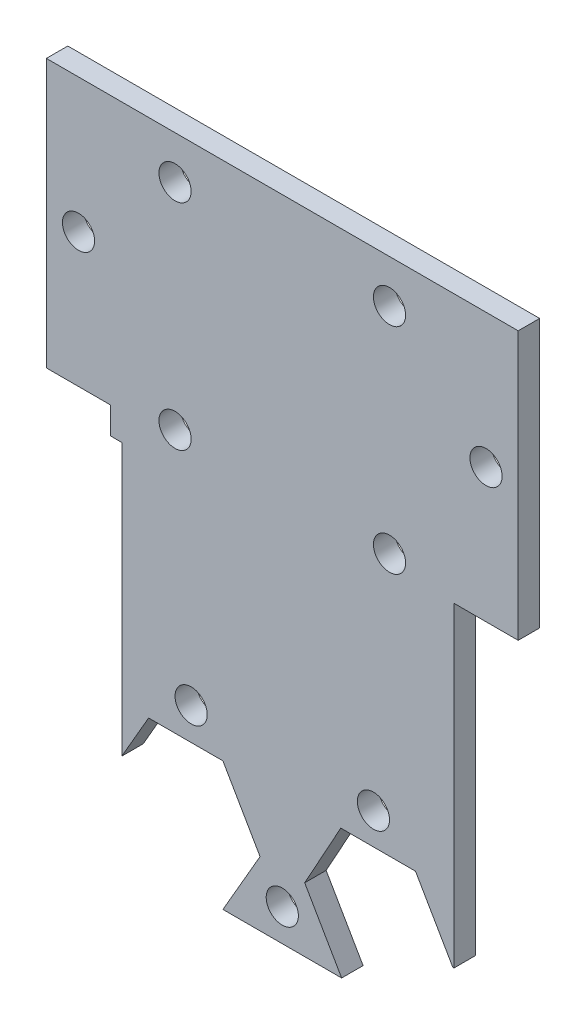
ISO-10303-21;
HEADER;
FILE_DESCRIPTION(('STEP AP214'),'2;1');
FILE_NAME('part.step','',(''),(''),'','','');
FILE_SCHEMA(('AUTOMOTIVE_DESIGN { 1 0 10303 214 1 1 1 1 }'));
ENDSEC;
DATA;
#1=APPLICATION_CONTEXT('core data for automotive mechanical design processes');
#2=APPLICATION_PROTOCOL_DEFINITION('international standard','automotive_design',2000,#1);
#3=PRODUCT_CONTEXT('',#1,'mechanical');
#4=PRODUCT('Part','Part','',(#3));
#5=PRODUCT_RELATED_PRODUCT_CATEGORY('part','',(#4));
#6=PRODUCT_DEFINITION_FORMATION('','',#4);
#7=PRODUCT_DEFINITION_CONTEXT('part definition',#1,'design');
#8=PRODUCT_DEFINITION('design','',#6,#7);
#9=PRODUCT_DEFINITION_SHAPE('','',#8);
#10=(LENGTH_UNIT() NAMED_UNIT(*) SI_UNIT(.MILLI.,.METRE.));
#11=(NAMED_UNIT(*) PLANE_ANGLE_UNIT() SI_UNIT($,.RADIAN.));
#12=(NAMED_UNIT(*) SI_UNIT($,.STERADIAN.) SOLID_ANGLE_UNIT());
#13=UNCERTAINTY_MEASURE_WITH_UNIT(LENGTH_MEASURE(1.E-05),#10,'distance_accuracy_value','');
#14=(GEOMETRIC_REPRESENTATION_CONTEXT(3) GLOBAL_UNCERTAINTY_ASSIGNED_CONTEXT((#13)) GLOBAL_UNIT_ASSIGNED_CONTEXT((#10,
#11,#12)) REPRESENTATION_CONTEXT('',''));
#15=CARTESIAN_POINT('',(0.,0.,0.));
#16=DIRECTION('',(0.,0.,1.));
#17=DIRECTION('',(1.,0.,0.));
#18=AXIS2_PLACEMENT_3D('',#15,#16,#17);
#19=CARTESIAN_POINT('',(16.0000000000013,0.,2.));
#20=DIRECTION('',(1.,0.,0.));
#21=DIRECTION('',(0.,1.,0.));
#22=AXIS2_PLACEMENT_3D('',#19,#20,#21);
#23=PLANE('',#22);
#24=DIRECTION('',(0.,0.,1.));
#25=VECTOR('',#24,1.);
#26=CARTESIAN_POINT('',(16.0000000000013,-40.4668979539107,2.));
#27=LINE('',#26,#25);
#28=CARTESIAN_POINT('',(16.0000000000013,-40.4668979539107,0.));
#29=VERTEX_POINT('',#28);
#30=CARTESIAN_POINT('',(16.0000000000013,-40.4668979539107,2.));
#31=VERTEX_POINT('',#30);
#32=EDGE_CURVE('E173',#29,#31,#27,.T.);
#33=ORIENTED_EDGE('',*,*,#32,.F.);
#34=DIRECTION('',(0.,-1.,0.));
#35=VECTOR('',#34,1.);
#36=CARTESIAN_POINT('',(16.0000000000013,0.,0.));
#37=LINE('',#36,#35);
#38=CARTESIAN_POINT('',(15.9999999999987,-10.9999999999692,0.));
#39=VERTEX_POINT('',#38);
#40=EDGE_CURVE('E271',#39,#29,#37,.T.);
#41=ORIENTED_EDGE('',*,*,#40,.F.);
#42=DIRECTION('',(0.,0.,-1.));
#43=VECTOR('',#42,1.);
#44=CARTESIAN_POINT('',(15.9999999999987,-10.9999999999692,27.7099202643649));
#45=LINE('',#44,#43);
#46=CARTESIAN_POINT('',(16.0000000000013,-10.9999999999692,2.));
#47=VERTEX_POINT('',#46);
#48=EDGE_CURVE('E56',#47,#39,#45,.T.);
#49=ORIENTED_EDGE('',*,*,#48,.F.);
#50=DIRECTION('',(0.,-1.,0.));
#51=VECTOR('',#50,1.);
#52=CARTESIAN_POINT('',(16.0000000000013,0.,2.));
#53=LINE('',#52,#51);
#54=EDGE_CURVE('E185',#47,#31,#53,.T.);
#55=ORIENTED_EDGE('',*,*,#54,.T.);
#56=EDGE_LOOP('',(#33,#41,#49,#55));
#57=FACE_BOUND('',#56,.T.);
#58=ADVANCED_FACE('F41',(#57),#23,.T.);
#59=CARTESIAN_POINT('',(0.,14.0000000000308,2.));
#60=DIRECTION('',(0.,1.,0.));
#61=DIRECTION('',(0.,0.,1.));
#62=AXIS2_PLACEMENT_3D('',#59,#60,#61);
#63=PLANE('',#62);
#64=DIRECTION('',(1.,0.,0.));
#65=VECTOR('',#64,1.);
#66=CARTESIAN_POINT('',(0.,14.0000000000308,0.));
#67=LINE('',#66,#65);
#68=CARTESIAN_POINT('',(-21.9999999999987,14.0000000000308,0.));
#69=VERTEX_POINT('',#68);
#70=CARTESIAN_POINT('',(21.9999999999987,14.0000000000308,0.));
#71=VERTEX_POINT('',#70);
#72=EDGE_CURVE('E274',#69,#71,#67,.T.);
#73=ORIENTED_EDGE('',*,*,#72,.F.);
#74=DIRECTION('',(0.,0.,-1.));
#75=VECTOR('',#74,1.);
#76=CARTESIAN_POINT('',(-21.9999999999987,14.0000000000308,27.7099202643649));
#77=LINE('',#76,#75);
#78=CARTESIAN_POINT('',(-21.9999999999987,14.0000000000308,2.));
#79=VERTEX_POINT('',#78);
#80=EDGE_CURVE('E410',#79,#69,#77,.T.);
#81=ORIENTED_EDGE('',*,*,#80,.F.);
#82=DIRECTION('',(1.,0.,0.));
#83=VECTOR('',#82,1.);
#84=CARTESIAN_POINT('',(0.,14.0000000000308,2.));
#85=LINE('',#84,#83);
#86=CARTESIAN_POINT('',(21.9999999999987,14.0000000000308,2.00000000000001));
#87=VERTEX_POINT('',#86);
#88=EDGE_CURVE('E193',#79,#87,#85,.T.);
#89=ORIENTED_EDGE('',*,*,#88,.T.);
#90=DIRECTION('',(0.,0.,-1.));
#91=VECTOR('',#90,1.);
#92=CARTESIAN_POINT('',(21.9999999999987,14.0000000000308,27.7099202643649));
#93=LINE('',#92,#91);
#94=EDGE_CURVE('E436',#87,#71,#93,.T.);
#95=ORIENTED_EDGE('',*,*,#94,.T.);
#96=EDGE_LOOP('',(#73,#81,#89,#95));
#97=FACE_BOUND('',#96,.T.);
#98=ADVANCED_FACE('F470',(#97),#63,.T.);
#99=CARTESIAN_POINT('',(-15.9999999999987,0.,2.));
#100=DIRECTION('',(1.,0.,0.));
#101=DIRECTION('',(0.,1.,0.));
#102=AXIS2_PLACEMENT_3D('',#99,#100,#101);
#103=PLANE('',#102);
#104=DIRECTION('',(0.,-1.,0.));
#105=VECTOR('',#104,1.);
#106=CARTESIAN_POINT('',(-15.9999999999987,0.,2.));
#107=LINE('',#106,#105);
#108=CARTESIAN_POINT('',(-15.9999999999987,-10.9999999999692,2.));
#109=VERTEX_POINT('',#108);
#110=CARTESIAN_POINT('',(-15.9999999999987,-13.4999999999692,2.));
#111=VERTEX_POINT('',#110);
#112=EDGE_CURVE('E198',#109,#111,#107,.T.);
#113=ORIENTED_EDGE('',*,*,#112,.F.);
#114=DIRECTION('',(0.,0.,-1.));
#115=VECTOR('',#114,1.);
#116=CARTESIAN_POINT('',(-15.9999999999987,-10.9999999999692,27.7099202643649));
#117=LINE('',#116,#115);
#118=CARTESIAN_POINT('',(-15.9999999999987,-10.9999999999692,0.));
#119=VERTEX_POINT('',#118);
#120=EDGE_CURVE('E204',#109,#119,#117,.T.);
#121=ORIENTED_EDGE('',*,*,#120,.T.);
#122=DIRECTION('',(0.,-1.,0.));
#123=VECTOR('',#122,1.);
#124=CARTESIAN_POINT('',(-15.9999999999987,0.,0.));
#125=LINE('',#124,#123);
#126=CARTESIAN_POINT('',(-15.9999999999987,-13.4999999999692,0.));
#127=VERTEX_POINT('',#126);
#128=EDGE_CURVE('E278',#119,#127,#125,.T.);
#129=ORIENTED_EDGE('',*,*,#128,.T.);
#130=DIRECTION('',(0.,0.,-1.));
#131=VECTOR('',#130,1.);
#132=CARTESIAN_POINT('',(-15.9999999999987,-13.4999999999692,2.));
#133=LINE('',#132,#131);
#134=EDGE_CURVE('E49',#111,#127,#133,.T.);
#135=ORIENTED_EDGE('',*,*,#134,.F.);
#136=EDGE_LOOP('',(#113,#121,#129,#135));
#137=FACE_BOUND('',#136,.T.);
#138=ADVANCED_FACE('F403',(#137),#103,.F.);
#139=CARTESIAN_POINT('',(0.,-13.4999999999692,2.));
#140=DIRECTION('',(0.,1.,0.));
#141=DIRECTION('',(-1.,0.,0.));
#142=AXIS2_PLACEMENT_3D('',#139,#140,#141);
#143=PLANE('',#142);
#144=DIRECTION('',(1.,0.,0.));
#145=VECTOR('',#144,1.);
#146=CARTESIAN_POINT('',(0.,-13.4999999999692,0.));
#147=LINE('',#146,#145);
#148=CARTESIAN_POINT('',(-14.9692936452084,-13.4999999999692,0.));
#149=VERTEX_POINT('',#148);
#150=EDGE_CURVE('E281',#127,#149,#147,.T.);
#151=ORIENTED_EDGE('',*,*,#150,.T.);
#152=DIRECTION('',(0.,0.,-1.));
#153=VECTOR('',#152,1.);
#154=CARTESIAN_POINT('',(-14.9692936452084,-13.4999999999692,2.));
#155=LINE('',#154,#153);
#156=CARTESIAN_POINT('',(-14.9692936452084,-13.4999999999692,2.));
#157=VERTEX_POINT('',#156);
#158=EDGE_CURVE('E377',#157,#149,#155,.T.);
#159=ORIENTED_EDGE('',*,*,#158,.F.);
#160=DIRECTION('',(1.,0.,0.));
#161=VECTOR('',#160,1.);
#162=CARTESIAN_POINT('',(0.,-13.4999999999692,2.));
#163=LINE('',#162,#161);
#164=EDGE_CURVE('E209',#111,#157,#163,.T.);
#165=ORIENTED_EDGE('',*,*,#164,.F.);
#166=ORIENTED_EDGE('',*,*,#134,.T.);
#167=EDGE_LOOP('',(#151,#159,#165,#166));
#168=FACE_BOUND('',#167,.T.);
#169=ADVANCED_FACE('F385',(#168),#143,.F.);
#170=CARTESIAN_POINT('',(-14.9692936452084,0.,2.));
#171=DIRECTION('',(-1.,0.,0.));
#172=DIRECTION('',(0.,0.,1.));
#173=AXIS2_PLACEMENT_3D('',#170,#171,#172);
#174=PLANE('',#173);
#175=DIRECTION('',(0.,1.,0.));
#176=VECTOR('',#175,1.);
#177=CARTESIAN_POINT('',(-14.9692936452084,0.,0.));
#178=LINE('',#177,#176);
#179=CARTESIAN_POINT('',(-14.9692936452084,-38.8391198787935,0.));
#180=VERTEX_POINT('',#179);
#181=EDGE_CURVE('E285',#180,#149,#178,.T.);
#182=ORIENTED_EDGE('',*,*,#181,.F.);
#183=DIRECTION('',(0.,0.,-1.));
#184=VECTOR('',#183,1.);
#185=CARTESIAN_POINT('',(-14.9692936452084,-38.8391198787935,2.));
#186=LINE('',#185,#184);
#187=CARTESIAN_POINT('',(-14.9692936452084,-38.8391198787935,2.));
#188=VERTEX_POINT('',#187);
#189=EDGE_CURVE('E374',#188,#180,#186,.T.);
#190=ORIENTED_EDGE('',*,*,#189,.F.);
#191=DIRECTION('',(0.,1.,0.));
#192=VECTOR('',#191,1.);
#193=CARTESIAN_POINT('',(-14.9692936452084,0.,2.));
#194=LINE('',#193,#192);
#195=EDGE_CURVE('E212',#188,#157,#194,.T.);
#196=ORIENTED_EDGE('',*,*,#195,.T.);
#197=ORIENTED_EDGE('',*,*,#158,.T.);
#198=EDGE_LOOP('',(#182,#190,#196,#197));
#199=FACE_BOUND('',#198,.T.);
#200=ADVANCED_FACE('F397',(#199),#174,.T.);
#201=CARTESIAN_POINT('',(5.59086200393073,-3.22788568297257,2.));
#202=DIRECTION('',(-0.866025403784364,0.500000000000129,0.));
#203=DIRECTION('',(-0.500000000000129,-0.866025403784364,0.));
#204=AXIS2_PLACEMENT_3D('',#201,#202,#203);
#205=PLANE('',#204);
#206=DIRECTION('',(0.500000000000129,0.866025403784364,0.));
#207=VECTOR('',#206,1.);
#208=CARTESIAN_POINT('',(5.59086200393073,-3.22788568297257,0.));
#209=LINE('',#208,#207);
#210=CARTESIAN_POINT('',(-12.4641016151356,-34.4999999999924,0.));
#211=VERTEX_POINT('',#210);
#212=EDGE_CURVE('E289',#180,#211,#209,.T.);
#213=ORIENTED_EDGE('',*,*,#212,.T.);
#214=DIRECTION('',(0.,0.,-1.));
#215=VECTOR('',#214,1.);
#216=CARTESIAN_POINT('',(-12.4641016151356,-34.4999999999924,2.));
#217=LINE('',#216,#215);
#218=CARTESIAN_POINT('',(-12.4641016151356,-34.4999999999924,2.));
#219=VERTEX_POINT('',#218);
#220=EDGE_CURVE('E370',#219,#211,#217,.T.);
#221=ORIENTED_EDGE('',*,*,#220,.F.);
#222=DIRECTION('',(0.500000000000129,0.866025403784364,0.));
#223=VECTOR('',#222,1.);
#224=CARTESIAN_POINT('',(5.59086200393073,-3.22788568297257,2.));
#225=LINE('',#224,#223);
#226=EDGE_CURVE('E216',#188,#219,#225,.T.);
#227=ORIENTED_EDGE('',*,*,#226,.F.);
#228=ORIENTED_EDGE('',*,*,#189,.T.);
#229=EDGE_LOOP('',(#213,#221,#227,#228));
#230=FACE_BOUND('',#229,.T.);
#231=ADVANCED_FACE('F506',(#230),#205,.F.);
#232=CARTESIAN_POINT('',(0.,-34.4999999999924,2.));
#233=DIRECTION('',(0.,1.,0.));
#234=DIRECTION('',(-1.,0.,0.));
#235=AXIS2_PLACEMENT_3D('',#232,#233,#234);
#236=PLANE('',#235);
#237=DIRECTION('',(1.,0.,0.));
#238=VECTOR('',#237,1.);
#239=CARTESIAN_POINT('',(0.,-34.4999999999924,0.));
#240=LINE('',#239,#238);
#241=CARTESIAN_POINT('',(-5.53589838486042,-34.4999999999924,0.));
#242=VERTEX_POINT('',#241);
#243=EDGE_CURVE('E292',#211,#242,#240,.T.);
#244=ORIENTED_EDGE('',*,*,#243,.T.);
#245=DIRECTION('',(0.,0.,-1.));
#246=VECTOR('',#245,1.);
#247=CARTESIAN_POINT('',(-5.53589838486042,-34.4999999999924,2.));
#248=LINE('',#247,#246);
#249=CARTESIAN_POINT('',(-5.53589838486042,-34.4999999999924,2.));
#250=VERTEX_POINT('',#249);
#251=EDGE_CURVE('E366',#250,#242,#248,.T.);
#252=ORIENTED_EDGE('',*,*,#251,.F.);
#253=DIRECTION('',(1.,0.,0.));
#254=VECTOR('',#253,1.);
#255=CARTESIAN_POINT('',(0.,-34.4999999999924,2.));
#256=LINE('',#255,#254);
#257=EDGE_CURVE('E219',#219,#250,#256,.T.);
#258=ORIENTED_EDGE('',*,*,#257,.F.);
#259=ORIENTED_EDGE('',*,*,#220,.T.);
#260=EDGE_LOOP('',(#244,#252,#258,#259));
#261=FACE_BOUND('',#260,.T.);
#262=ADVANCED_FACE('F509',(#261),#236,.F.);
#263=CARTESIAN_POINT('',(-19.0908620039236,-11.0221143170272,2.));
#264=DIRECTION('',(0.86602540378444,0.499999999999999,0.));
#265=DIRECTION('',(-0.499999999999999,0.86602540378444,0.));
#266=AXIS2_PLACEMENT_3D('',#263,#264,#265);
#267=PLANE('',#266);
#268=DIRECTION('',(0.499999999999999,-0.86602540378444,0.));
#269=VECTOR('',#268,1.);
#270=CARTESIAN_POINT('',(-19.0908620039236,-11.0221143170272,0.));
#271=LINE('',#270,#269);
#272=CARTESIAN_POINT('',(-2.07179676972283,-40.4999999999921,0.));
#273=VERTEX_POINT('',#272);
#274=EDGE_CURVE('E295',#242,#273,#271,.T.);
#275=ORIENTED_EDGE('',*,*,#274,.T.);
#276=DIRECTION('',(0.,0.,-1.));
#277=VECTOR('',#276,1.);
#278=CARTESIAN_POINT('',(-2.07179676972283,-40.4999999999921,2.));
#279=LINE('',#278,#277);
#280=CARTESIAN_POINT('',(-2.07179676972283,-40.4999999999921,2.));
#281=VERTEX_POINT('',#280);
#282=EDGE_CURVE('E362',#281,#273,#279,.T.);
#283=ORIENTED_EDGE('',*,*,#282,.F.);
#284=DIRECTION('',(0.499999999999999,-0.86602540378444,0.));
#285=VECTOR('',#284,1.);
#286=CARTESIAN_POINT('',(-19.0908620039236,-11.0221143170272,2.));
#287=LINE('',#286,#285);
#288=EDGE_CURVE('E222',#250,#281,#287,.T.);
#289=ORIENTED_EDGE('',*,*,#288,.F.);
#290=ORIENTED_EDGE('',*,*,#251,.T.);
#291=EDGE_LOOP('',(#275,#283,#289,#290));
#292=FACE_BOUND('',#291,.T.);
#293=ADVANCED_FACE('F513',(#292),#267,.F.);
#294=CARTESIAN_POINT('',(15.9831668493425,-9.22788568297358,2.));
#295=DIRECTION('',(0.866025403784368,-0.500000000000122,0.));
#296=DIRECTION('',(0.500000000000122,0.866025403784368,0.));
#297=AXIS2_PLACEMENT_3D('',#294,#295,#296);
#298=PLANE('',#297);
#299=DIRECTION('',(-0.500000000000122,-0.866025403784368,0.));
#300=VECTOR('',#299,1.);
#301=CARTESIAN_POINT('',(15.9831668493425,-9.22788568297358,0.));
#302=LINE('',#301,#300);
#303=CARTESIAN_POINT('',(-5.5358983848632,-46.4999999999947,0.));
#304=VERTEX_POINT('',#303);
#305=EDGE_CURVE('E298',#273,#304,#302,.T.);
#306=ORIENTED_EDGE('',*,*,#305,.T.);
#307=DIRECTION('',(0.,0.,-1.));
#308=VECTOR('',#307,1.);
#309=CARTESIAN_POINT('',(-5.5358983848632,-46.4999999999947,2.));
#310=LINE('',#309,#308);
#311=CARTESIAN_POINT('',(-5.5358983848632,-46.4999999999947,2.));
#312=VERTEX_POINT('',#311);
#313=EDGE_CURVE('E358',#312,#304,#310,.T.);
#314=ORIENTED_EDGE('',*,*,#313,.F.);
#315=DIRECTION('',(-0.500000000000122,-0.866025403784368,0.));
#316=VECTOR('',#315,1.);
#317=CARTESIAN_POINT('',(15.9831668493425,-9.22788568297358,2.));
#318=LINE('',#317,#316);
#319=EDGE_CURVE('E225',#281,#312,#318,.T.);
#320=ORIENTED_EDGE('',*,*,#319,.F.);
#321=ORIENTED_EDGE('',*,*,#282,.T.);
#322=EDGE_LOOP('',(#306,#314,#320,#321));
#323=FACE_BOUND('',#322,.T.);
#324=ADVANCED_FACE('F517',(#323),#298,.F.);
#325=CARTESIAN_POINT('',(0.,-46.4999999999947,2.));
#326=DIRECTION('',(0.,1.,0.));
#327=DIRECTION('',(0.,0.,1.));
#328=AXIS2_PLACEMENT_3D('',#325,#326,#327);
#329=PLANE('',#328);
#330=DIRECTION('',(1.,0.,0.));
#331=VECTOR('',#330,1.);
#332=CARTESIAN_POINT('',(0.,-46.4999999999947,0.));
#333=LINE('',#332,#331);
#334=CARTESIAN_POINT('',(5.5358983848654,-46.4999999999947,0.));
#335=VERTEX_POINT('',#334);
#336=EDGE_CURVE('E301',#304,#335,#333,.T.);
#337=ORIENTED_EDGE('',*,*,#336,.T.);
#338=DIRECTION('',(0.,0.,-1.));
#339=VECTOR('',#338,1.);
#340=CARTESIAN_POINT('',(5.5358983848654,-46.4999999999947,2.));
#341=LINE('',#340,#339);
#342=CARTESIAN_POINT('',(5.5358983848654,-46.4999999999947,2.));
#343=VERTEX_POINT('',#342);
#344=EDGE_CURVE('E354',#343,#335,#341,.T.);
#345=ORIENTED_EDGE('',*,*,#344,.F.);
#346=DIRECTION('',(1.,0.,0.));
#347=VECTOR('',#346,1.);
#348=CARTESIAN_POINT('',(0.,-46.4999999999947,2.));
#349=LINE('',#348,#347);
#350=EDGE_CURVE('E228',#312,#343,#349,.T.);
#351=ORIENTED_EDGE('',*,*,#350,.F.);
#352=ORIENTED_EDGE('',*,*,#313,.T.);
#353=EDGE_LOOP('',(#337,#345,#351,#352));
#354=FACE_BOUND('',#353,.T.);
#355=ADVANCED_FACE('F521',(#354),#329,.F.);
#356=CARTESIAN_POINT('',(-15.9831668493368,-9.22788568296724,2.));
#357=DIRECTION('',(-0.86602540378444,-0.499999999999998,0.));
#358=DIRECTION('',(0.499999999999998,-0.86602540378444,0.));
#359=AXIS2_PLACEMENT_3D('',#356,#357,#358);
#360=PLANE('',#359);
#361=DIRECTION('',(-0.499999999999998,0.86602540378444,0.));
#362=VECTOR('',#361,1.);
#363=CARTESIAN_POINT('',(-15.9831668493368,-9.22788568296724,0.));
#364=LINE('',#363,#362);
#365=CARTESIAN_POINT('',(2.09085386194625,-40.5330078519618,0.));
#366=VERTEX_POINT('',#365);
#367=EDGE_CURVE('E304',#335,#366,#364,.T.);
#368=ORIENTED_EDGE('',*,*,#367,.T.);
#369=DIRECTION('',(0.,0.,-1.));
#370=VECTOR('',#369,1.);
#371=CARTESIAN_POINT('',(2.09085386194625,-40.5330078519618,2.));
#372=LINE('',#371,#370);
#373=CARTESIAN_POINT('',(2.09085386194625,-40.5330078519618,2.));
#374=VERTEX_POINT('',#373);
#375=EDGE_CURVE('E350',#374,#366,#372,.T.);
#376=ORIENTED_EDGE('',*,*,#375,.F.);
#377=DIRECTION('',(-0.499999999999998,0.86602540378444,0.));
#378=VECTOR('',#377,1.);
#379=CARTESIAN_POINT('',(-15.9831668493368,-9.22788568296724,2.));
#380=LINE('',#379,#378);
#381=EDGE_CURVE('E231',#343,#374,#380,.T.);
#382=ORIENTED_EDGE('',*,*,#381,.F.);
#383=ORIENTED_EDGE('',*,*,#344,.T.);
#384=EDGE_LOOP('',(#368,#376,#382,#383));
#385=FACE_BOUND('',#384,.T.);
#386=ADVANCED_FACE('F525',(#385),#360,.F.);
#387=CARTESIAN_POINT('',(18.7504291081606,-10.3489943214688,2.));
#388=DIRECTION('',(-0.875500057429838,0.483218014399661,0.));
#389=DIRECTION('',(-0.483218014399661,-0.875500057429838,0.));
#390=AXIS2_PLACEMENT_3D('',#387,#388,#389);
#391=PLANE('',#390);
#392=DIRECTION('',(0.483218014399661,0.875500057429838,0.));
#393=VECTOR('',#392,1.);
#394=CARTESIAN_POINT('',(18.7504291081606,-10.3489943214688,0.));
#395=LINE('',#394,#393);
#396=CARTESIAN_POINT('',(5.45772916641325,-34.4328637460305,0.));
#397=VERTEX_POINT('',#396);
#398=EDGE_CURVE('E307',#366,#397,#395,.T.);
#399=ORIENTED_EDGE('',*,*,#398,.T.);
#400=DIRECTION('',(0.,0.,-1.));
#401=VECTOR('',#400,1.);
#402=CARTESIAN_POINT('',(5.45772916641325,-34.4328637460305,2.));
#403=LINE('',#402,#401);
#404=CARTESIAN_POINT('',(5.45772916641325,-34.4328637460305,2.));
#405=VERTEX_POINT('',#404);
#406=EDGE_CURVE('E346',#405,#397,#403,.T.);
#407=ORIENTED_EDGE('',*,*,#406,.F.);
#408=DIRECTION('',(0.483218014399661,0.875500057429838,0.));
#409=VECTOR('',#408,1.);
#410=CARTESIAN_POINT('',(18.7504291081606,-10.3489943214688,2.));
#411=LINE('',#410,#409);
#412=EDGE_CURVE('E234',#374,#405,#411,.T.);
#413=ORIENTED_EDGE('',*,*,#412,.F.);
#414=ORIENTED_EDGE('',*,*,#375,.T.);
#415=EDGE_LOOP('',(#399,#407,#413,#414));
#416=FACE_BOUND('',#415,.T.);
#417=ADVANCED_FACE('F529',(#416),#391,.F.);
#418=CARTESIAN_POINT('',(0.,-34.4328637460304,2.));
#419=DIRECTION('',(0.,1.,0.));
#420=DIRECTION('',(-1.,0.,0.));
#421=AXIS2_PLACEMENT_3D('',#418,#419,#420);
#422=PLANE('',#421);
#423=DIRECTION('',(1.,0.,0.));
#424=VECTOR('',#423,1.);
#425=CARTESIAN_POINT('',(0.,-34.4328637460304,0.));
#426=LINE('',#425,#424);
#427=CARTESIAN_POINT('',(12.4253404808423,-34.4328637460305,0.));
#428=VERTEX_POINT('',#427);
#429=EDGE_CURVE('E310',#397,#428,#426,.T.);
#430=ORIENTED_EDGE('',*,*,#429,.T.);
#431=DIRECTION('',(0.,0.,-1.));
#432=VECTOR('',#431,1.);
#433=CARTESIAN_POINT('',(12.4253404808423,-34.4328637460305,2.));
#434=LINE('',#433,#432);
#435=CARTESIAN_POINT('',(12.4253404808423,-34.4328637460305,2.));
#436=VERTEX_POINT('',#435);
#437=EDGE_CURVE('E342',#436,#428,#434,.T.);
#438=ORIENTED_EDGE('',*,*,#437,.F.);
#439=DIRECTION('',(1.,0.,0.));
#440=VECTOR('',#439,1.);
#441=CARTESIAN_POINT('',(0.,-34.4328637460304,2.));
#442=LINE('',#441,#440);
#443=EDGE_CURVE('E237',#405,#436,#442,.T.);
#444=ORIENTED_EDGE('',*,*,#443,.F.);
#445=ORIENTED_EDGE('',*,*,#406,.T.);
#446=EDGE_LOOP('',(#430,#438,#444,#445));
#447=FACE_BOUND('',#446,.T.);
#448=ADVANCED_FACE('F533',(#447),#422,.F.);
#449=CARTESIAN_POINT('',(-5.59086200392354,-3.22788568296729,2.));
#450=DIRECTION('',(0.86602540378444,0.499999999999999,0.));
#451=DIRECTION('',(-0.499999999999999,0.86602540378444,0.));
#452=AXIS2_PLACEMENT_3D('',#449,#450,#451);
#453=PLANE('',#452);
#454=DIRECTION('',(0.499999999999999,-0.86602540378444,0.));
#455=VECTOR('',#454,1.);
#456=CARTESIAN_POINT('',(-5.59086200392354,-3.22788568296729,0.));
#457=LINE('',#456,#455);
#458=CARTESIAN_POINT('',(15.9091461380568,-40.4669921480219,0.));
#459=VERTEX_POINT('',#458);
#460=EDGE_CURVE('E313',#428,#459,#457,.T.);
#461=ORIENTED_EDGE('',*,*,#460,.T.);
#462=DIRECTION('',(0.,0.,-1.));
#463=VECTOR('',#462,1.);
#464=CARTESIAN_POINT('',(15.9091461380568,-40.4669921480219,2.));
#465=LINE('',#464,#463);
#466=CARTESIAN_POINT('',(15.9091461380568,-40.4669921480219,2.));
#467=VERTEX_POINT('',#466);
#468=EDGE_CURVE('E270',#467,#459,#465,.T.);
#469=ORIENTED_EDGE('',*,*,#468,.F.);
#470=DIRECTION('',(0.499999999999999,-0.86602540378444,0.));
#471=VECTOR('',#470,1.);
#472=CARTESIAN_POINT('',(-5.59086200392354,-3.22788568296729,2.));
#473=LINE('',#472,#471);
#474=EDGE_CURVE('E188',#436,#467,#473,.T.);
#475=ORIENTED_EDGE('',*,*,#474,.F.);
#476=ORIENTED_EDGE('',*,*,#437,.T.);
#477=EDGE_LOOP('',(#461,#469,#475,#476));
#478=FACE_BOUND('',#477,.T.);
#479=ADVANCED_FACE('F537',(#478),#453,.F.);
#480=CARTESIAN_POINT('',(10.0000000000013,-9.99999999996919,2.));
#481=DIRECTION('',(0.,0.,-1.));
#482=DIRECTION('',(-1.,0.,0.));
#483=AXIS2_PLACEMENT_3D('',#480,#481,#482);
#484=CYLINDRICAL_SURFACE('',#483,1.50000000110803);
#485=CARTESIAN_POINT('',(10.0000000000013,-9.99999999996919,2.));
#486=DIRECTION('',(0.,0.,1.));
#487=DIRECTION('',(1.,0.,0.));
#488=AXIS2_PLACEMENT_3D('',#485,#486,#487);
#489=CIRCLE('',#488,1.50000000110803);
#490=CARTESIAN_POINT('',(11.5000000011093,-9.99999999996919,2.));
#491=VERTEX_POINT('',#490);
#492=EDGE_CURVE('E262',#491,#491,#489,.T.);
#493=ORIENTED_EDGE('',*,*,#492,.T.);
#494=EDGE_LOOP('',(#493));
#495=FACE_BOUND('',#494,.T.);
#496=CARTESIAN_POINT('',(10.0000000000013,-9.99999999996919,0.));
#497=DIRECTION('',(0.,0.,1.));
#498=DIRECTION('',(1.,0.,0.));
#499=AXIS2_PLACEMENT_3D('',#496,#497,#498);
#500=CIRCLE('',#499,1.50000000110803);
#501=CARTESIAN_POINT('',(11.5000000011093,-9.99999999996919,0.));
#502=VERTEX_POINT('',#501);
#503=EDGE_CURVE('E201',#502,#502,#500,.T.);
#504=ORIENTED_EDGE('',*,*,#503,.F.);
#505=EDGE_LOOP('',(#504));
#506=FACE_BOUND('',#505,.T.);
#507=ADVANCED_FACE('F541',(#495,#506),#484,.F.);
#508=CARTESIAN_POINT('',(10.0000000000013,10.0000000000308,2.));
#509=DIRECTION('',(0.,0.,-1.));
#510=DIRECTION('',(-1.,0.,0.));
#511=AXIS2_PLACEMENT_3D('',#508,#509,#510);
#512=CYLINDRICAL_SURFACE('',#511,1.50000000110803);
#513=CARTESIAN_POINT('',(10.0000000000013,10.0000000000308,2.));
#514=DIRECTION('',(0.,0.,1.));
#515=DIRECTION('',(1.,0.,0.));
#516=AXIS2_PLACEMENT_3D('',#513,#514,#515);
#517=CIRCLE('',#516,1.50000000110803);
#518=CARTESIAN_POINT('',(11.5000000011093,10.0000000000308,2.));
#519=VERTEX_POINT('',#518);
#520=EDGE_CURVE('E258',#519,#519,#517,.T.);
#521=ORIENTED_EDGE('',*,*,#520,.T.);
#522=EDGE_LOOP('',(#521));
#523=FACE_BOUND('',#522,.T.);
#524=CARTESIAN_POINT('',(10.0000000000013,10.0000000000308,0.));
#525=DIRECTION('',(0.,0.,1.));
#526=DIRECTION('',(1.,0.,0.));
#527=AXIS2_PLACEMENT_3D('',#524,#525,#526);
#528=CIRCLE('',#527,1.50000000110803);
#529=CARTESIAN_POINT('',(11.5000000011093,10.0000000000308,0.));
#530=VERTEX_POINT('',#529);
#531=EDGE_CURVE('E333',#530,#530,#528,.T.);
#532=ORIENTED_EDGE('',*,*,#531,.F.);
#533=EDGE_LOOP('',(#532));
#534=FACE_BOUND('',#533,.T.);
#535=ADVANCED_FACE('F558',(#523,#534),#512,.F.);
#536=CARTESIAN_POINT('',(-9.99999999999872,10.0000000000308,2.));
#537=DIRECTION('',(0.,0.,-1.));
#538=DIRECTION('',(-1.,0.,0.));
#539=AXIS2_PLACEMENT_3D('',#536,#537,#538);
#540=CYLINDRICAL_SURFACE('',#539,1.50000000110803);
#541=CARTESIAN_POINT('',(-9.99999999999872,10.0000000000308,2.));
#542=DIRECTION('',(0.,0.,1.));
#543=DIRECTION('',(1.,0.,0.));
#544=AXIS2_PLACEMENT_3D('',#541,#542,#543);
#545=CIRCLE('',#544,1.50000000110803);
#546=CARTESIAN_POINT('',(-8.49999999889069,10.0000000000308,2.));
#547=VERTEX_POINT('',#546);
#548=EDGE_CURVE('E254',#547,#547,#545,.T.);
#549=ORIENTED_EDGE('',*,*,#548,.T.);
#550=EDGE_LOOP('',(#549));
#551=FACE_BOUND('',#550,.T.);
#552=CARTESIAN_POINT('',(-9.99999999999872,10.0000000000308,0.));
#553=DIRECTION('',(0.,0.,1.));
#554=DIRECTION('',(1.,0.,0.));
#555=AXIS2_PLACEMENT_3D('',#552,#553,#554);
#556=CIRCLE('',#555,1.50000000110803);
#557=CARTESIAN_POINT('',(-8.49999999889069,10.0000000000308,0.));
#558=VERTEX_POINT('',#557);
#559=EDGE_CURVE('E329',#558,#558,#556,.T.);
#560=ORIENTED_EDGE('',*,*,#559,.F.);
#561=EDGE_LOOP('',(#560));
#562=FACE_BOUND('',#561,.T.);
#563=ADVANCED_FACE('F554',(#551,#562),#540,.F.);
#564=CARTESIAN_POINT('',(8.5000000000015,-31.4999999999948,2.));
#565=DIRECTION('',(0.,0.,-1.));
#566=DIRECTION('',(-1.,0.,0.));
#567=AXIS2_PLACEMENT_3D('',#564,#565,#566);
#568=CYLINDRICAL_SURFACE('',#567,1.50000000000081);
#569=CARTESIAN_POINT('',(8.5000000000015,-31.4999999999948,2.));
#570=DIRECTION('',(0.,0.,1.));
#571=DIRECTION('',(1.,0.,0.));
#572=AXIS2_PLACEMENT_3D('',#569,#570,#571);
#573=CIRCLE('',#572,1.50000000000081);
#574=CARTESIAN_POINT('',(10.0000000000023,-31.4999999999948,2.));
#575=VERTEX_POINT('',#574);
#576=EDGE_CURVE('E250',#575,#575,#573,.T.);
#577=ORIENTED_EDGE('',*,*,#576,.T.);
#578=EDGE_LOOP('',(#577));
#579=FACE_BOUND('',#578,.T.);
#580=CARTESIAN_POINT('',(8.5000000000015,-31.4999999999948,0.));
#581=DIRECTION('',(0.,0.,1.));
#582=DIRECTION('',(1.,0.,0.));
#583=AXIS2_PLACEMENT_3D('',#580,#581,#582);
#584=CIRCLE('',#583,1.50000000000081);
#585=CARTESIAN_POINT('',(10.0000000000023,-31.4999999999948,0.));
#586=VERTEX_POINT('',#585);
#587=EDGE_CURVE('E325',#586,#586,#584,.T.);
#588=ORIENTED_EDGE('',*,*,#587,.F.);
#589=EDGE_LOOP('',(#588));
#590=FACE_BOUND('',#589,.T.);
#591=ADVANCED_FACE('F550',(#579,#590),#568,.F.);
#592=CARTESIAN_POINT('',(-8.4999999999985,-31.4999999999947,2.));
#593=DIRECTION('',(0.,0.,-1.));
#594=DIRECTION('',(-1.,0.,0.));
#595=AXIS2_PLACEMENT_3D('',#592,#593,#594);
#596=CYLINDRICAL_SURFACE('',#595,1.50000000000082);
#597=CARTESIAN_POINT('',(-8.4999999999985,-31.4999999999947,2.));
#598=DIRECTION('',(0.,0.,1.));
#599=DIRECTION('',(1.,0.,0.));
#600=AXIS2_PLACEMENT_3D('',#597,#598,#599);
#601=CIRCLE('',#600,1.50000000000082);
#602=CARTESIAN_POINT('',(-6.99999999999768,-31.4999999999947,2.));
#603=VERTEX_POINT('',#602);
#604=EDGE_CURVE('E246',#603,#603,#601,.T.);
#605=ORIENTED_EDGE('',*,*,#604,.T.);
#606=EDGE_LOOP('',(#605));
#607=FACE_BOUND('',#606,.T.);
#608=CARTESIAN_POINT('',(-8.4999999999985,-31.4999999999947,0.));
#609=DIRECTION('',(0.,0.,1.));
#610=DIRECTION('',(1.,0.,0.));
#611=AXIS2_PLACEMENT_3D('',#608,#609,#610);
#612=CIRCLE('',#611,1.50000000000082);
#613=CARTESIAN_POINT('',(-6.99999999999768,-31.4999999999947,0.));
#614=VERTEX_POINT('',#613);
#615=EDGE_CURVE('E321',#614,#614,#612,.T.);
#616=ORIENTED_EDGE('',*,*,#615,.F.);
#617=EDGE_LOOP('',(#616));
#618=FACE_BOUND('',#617,.T.);
#619=ADVANCED_FACE('F546',(#607,#618),#596,.F.);
#620=CARTESIAN_POINT('',(1.47176023156259E-12,-43.4999999999947,2.));
#621=DIRECTION('',(0.,0.,-1.));
#622=DIRECTION('',(-1.,0.,0.));
#623=AXIS2_PLACEMENT_3D('',#620,#621,#622);
#624=CYLINDRICAL_SURFACE('',#623,1.50000000000083);
#625=CARTESIAN_POINT('',(1.47176023156259E-12,-43.4999999999947,2.));
#626=DIRECTION('',(0.,0.,1.));
#627=DIRECTION('',(1.,0.,0.));
#628=AXIS2_PLACEMENT_3D('',#625,#626,#627);
#629=CIRCLE('',#628,1.50000000000083);
#630=CARTESIAN_POINT('',(1.5000000000023,-43.4999999999947,2.));
#631=VERTEX_POINT('',#630);
#632=EDGE_CURVE('E242',#631,#631,#629,.T.);
#633=ORIENTED_EDGE('',*,*,#632,.T.);
#634=EDGE_LOOP('',(#633));
#635=FACE_BOUND('',#634,.T.);
#636=CARTESIAN_POINT('',(1.47176023156259E-12,-43.4999999999947,0.));
#637=DIRECTION('',(0.,0.,1.));
#638=DIRECTION('',(1.,0.,0.));
#639=AXIS2_PLACEMENT_3D('',#636,#637,#638);
#640=CIRCLE('',#639,1.50000000000083);
#641=CARTESIAN_POINT('',(1.5000000000023,-43.4999999999947,0.));
#642=VERTEX_POINT('',#641);
#643=EDGE_CURVE('E317',#642,#642,#640,.T.);
#644=ORIENTED_EDGE('',*,*,#643,.F.);
#645=EDGE_LOOP('',(#644));
#646=FACE_BOUND('',#645,.T.);
#647=ADVANCED_FACE('F543',(#635,#646),#624,.F.);
#648=CARTESIAN_POINT('',(-9.99999999999872,-9.99999999996919,2.));
#649=DIRECTION('',(0.,0.,-1.));
#650=DIRECTION('',(-1.,0.,0.));
#651=AXIS2_PLACEMENT_3D('',#648,#649,#650);
#652=CYLINDRICAL_SURFACE('',#651,1.50000000110803);
#653=CARTESIAN_POINT('',(-9.99999999999872,-9.99999999996919,2.));
#654=DIRECTION('',(0.,0.,1.));
#655=DIRECTION('',(1.,0.,0.));
#656=AXIS2_PLACEMENT_3D('',#653,#654,#655);
#657=CIRCLE('',#656,1.50000000110803);
#658=CARTESIAN_POINT('',(-8.49999999889069,-9.99999999996919,2.));
#659=VERTEX_POINT('',#658);
#660=EDGE_CURVE('E266',#659,#659,#657,.T.);
#661=ORIENTED_EDGE('',*,*,#660,.T.);
#662=EDGE_LOOP('',(#661));
#663=FACE_BOUND('',#662,.T.);
#664=CARTESIAN_POINT('',(-9.99999999999872,-9.99999999996919,0.));
#665=DIRECTION('',(0.,0.,1.));
#666=DIRECTION('',(1.,0.,0.));
#667=AXIS2_PLACEMENT_3D('',#664,#665,#666);
#668=CIRCLE('',#667,1.50000000110803);
#669=CARTESIAN_POINT('',(-8.49999999889069,-9.99999999996919,0.));
#670=VERTEX_POINT('',#669);
#671=EDGE_CURVE('E194',#670,#670,#668,.T.);
#672=ORIENTED_EDGE('',*,*,#671,.F.);
#673=EDGE_LOOP('',(#672));
#674=FACE_BOUND('',#673,.T.);
#675=ADVANCED_FACE('F490',(#663,#674),#652,.F.);
#676=CARTESIAN_POINT('',(0.,0.,2.));
#677=DIRECTION('',(0.,0.,1.));
#678=DIRECTION('',(1.,0.,0.));
#679=AXIS2_PLACEMENT_3D('',#676,#677,#678);
#680=PLANE('',#679);
#681=DIRECTION('',(-0.999999462559521,-0.00103676451981375,0.));
#682=VECTOR('',#681,1.);
#683=CARTESIAN_POINT('',(0.041971819568127,-40.4834426802262,2.));
#684=LINE('',#683,#682);
#685=EDGE_CURVE('E176',#31,#467,#684,.T.);
#686=ORIENTED_EDGE('',*,*,#685,.F.);
#687=ORIENTED_EDGE('',*,*,#54,.F.);
#688=DIRECTION('',(-1.,0.,0.));
#689=VECTOR('',#688,1.);
#690=CARTESIAN_POINT('',(15.9999999999987,-10.9999999999692,2.));
#691=LINE('',#690,#689);
#692=CARTESIAN_POINT('',(21.9999999999987,-10.9999999999692,2.));
#693=VERTEX_POINT('',#692);
#694=EDGE_CURVE('E180',#693,#47,#691,.T.);
#695=ORIENTED_EDGE('',*,*,#694,.F.);
#696=DIRECTION('',(0.,-1.,0.));
#697=VECTOR('',#696,1.);
#698=CARTESIAN_POINT('',(21.9999999999987,14.0000000000308,2.));
#699=LINE('',#698,#697);
#700=EDGE_CURVE('E427',#87,#693,#699,.T.);
#701=ORIENTED_EDGE('',*,*,#700,.F.);
#702=ORIENTED_EDGE('',*,*,#88,.F.);
#703=DIRECTION('',(0.,1.,0.));
#704=VECTOR('',#703,1.);
#705=CARTESIAN_POINT('',(-21.9999999999987,14.0000000000308,2.));
#706=LINE('',#705,#704);
#707=CARTESIAN_POINT('',(-21.9999999999987,-10.9999999999692,2.00000000000001));
#708=VERTEX_POINT('',#707);
#709=EDGE_CURVE('E405',#708,#79,#706,.T.);
#710=ORIENTED_EDGE('',*,*,#709,.F.);
#711=DIRECTION('',(-1.,0.,0.));
#712=VECTOR('',#711,1.);
#713=CARTESIAN_POINT('',(-15.9999999999987,-10.9999999999692,2.));
#714=LINE('',#713,#712);
#715=EDGE_CURVE('E402',#109,#708,#714,.T.);
#716=ORIENTED_EDGE('',*,*,#715,.F.);
#717=ORIENTED_EDGE('',*,*,#112,.T.);
#718=ORIENTED_EDGE('',*,*,#164,.T.);
#719=ORIENTED_EDGE('',*,*,#195,.F.);
#720=ORIENTED_EDGE('',*,*,#226,.T.);
#721=ORIENTED_EDGE('',*,*,#257,.T.);
#722=ORIENTED_EDGE('',*,*,#288,.T.);
#723=ORIENTED_EDGE('',*,*,#319,.T.);
#724=ORIENTED_EDGE('',*,*,#350,.T.);
#725=ORIENTED_EDGE('',*,*,#381,.T.);
#726=ORIENTED_EDGE('',*,*,#412,.T.);
#727=ORIENTED_EDGE('',*,*,#443,.T.);
#728=ORIENTED_EDGE('',*,*,#474,.T.);
#729=EDGE_LOOP('',(#686,#687,#695,#701,#702,#710,#716,#717,#718,#719,#720,#721,#722,#723,#724,
#725,#726,#727,#728));
#730=FACE_BOUND('',#729,.T.);
#731=ORIENTED_EDGE('',*,*,#632,.F.);
#732=EDGE_LOOP('',(#731));
#733=FACE_BOUND('',#732,.T.);
#734=ORIENTED_EDGE('',*,*,#604,.F.);
#735=EDGE_LOOP('',(#734));
#736=FACE_BOUND('',#735,.T.);
#737=ORIENTED_EDGE('',*,*,#576,.F.);
#738=EDGE_LOOP('',(#737));
#739=FACE_BOUND('',#738,.T.);
#740=ORIENTED_EDGE('',*,*,#548,.F.);
#741=EDGE_LOOP('',(#740));
#742=FACE_BOUND('',#741,.T.);
#743=ORIENTED_EDGE('',*,*,#520,.F.);
#744=EDGE_LOOP('',(#743));
#745=FACE_BOUND('',#744,.T.);
#746=ORIENTED_EDGE('',*,*,#492,.F.);
#747=EDGE_LOOP('',(#746));
#748=FACE_BOUND('',#747,.T.);
#749=ORIENTED_EDGE('',*,*,#660,.F.);
#750=EDGE_LOOP('',(#749));
#751=FACE_BOUND('',#750,.T.);
#752=CARTESIAN_POINT('',(-18.9999999999987,1.50000000003081,2.));
#753=DIRECTION('',(0.,0.,1.));
#754=DIRECTION('',(1.,0.,0.));
#755=AXIS2_PLACEMENT_3D('',#752,#753,#754);
#756=CIRCLE('',#755,1.5);
#757=CARTESIAN_POINT('',(-17.4999999999987,1.50000000003081,2.));
#758=VERTEX_POINT('',#757);
#759=EDGE_CURVE('E275',#758,#758,#756,.F.);
#760=ORIENTED_EDGE('',*,*,#759,.T.);
#761=EDGE_LOOP('',(#760));
#762=FACE_BOUND('',#761,.T.);
#763=CARTESIAN_POINT('',(18.9999999999987,1.50000000003081,2.));
#764=DIRECTION('',(0.,0.,1.));
#765=DIRECTION('',(1.,0.,0.));
#766=AXIS2_PLACEMENT_3D('',#763,#764,#765);
#767=CIRCLE('',#766,1.5);
#768=CARTESIAN_POINT('',(20.4999999999987,1.50000000003081,2.));
#769=VERTEX_POINT('',#768);
#770=EDGE_CURVE('E406',#769,#769,#767,.F.);
#771=ORIENTED_EDGE('',*,*,#770,.T.);
#772=EDGE_LOOP('',(#771));
#773=FACE_BOUND('',#772,.T.);
#774=ADVANCED_FACE('F183',(#730,#733,#736,#739,#742,#745,#748,#751,#762,#773),#680,.T.);
#775=CARTESIAN_POINT('',(0.,0.,0.));
#776=DIRECTION('',(0.,0.,1.));
#777=DIRECTION('',(1.,0.,0.));
#778=AXIS2_PLACEMENT_3D('',#775,#776,#777);
#779=PLANE('',#778);
#780=ORIENTED_EDGE('',*,*,#40,.T.);
#781=DIRECTION('',(-0.999999462559521,-0.00103676451981375,0.));
#782=VECTOR('',#781,1.);
#783=CARTESIAN_POINT('',(0.041971819568127,-40.4834426802262,0.));
#784=LINE('',#783,#782);
#785=EDGE_CURVE('E11',#29,#459,#784,.T.);
#786=ORIENTED_EDGE('',*,*,#785,.T.);
#787=ORIENTED_EDGE('',*,*,#460,.F.);
#788=ORIENTED_EDGE('',*,*,#429,.F.);
#789=ORIENTED_EDGE('',*,*,#398,.F.);
#790=ORIENTED_EDGE('',*,*,#367,.F.);
#791=ORIENTED_EDGE('',*,*,#336,.F.);
#792=ORIENTED_EDGE('',*,*,#305,.F.);
#793=ORIENTED_EDGE('',*,*,#274,.F.);
#794=ORIENTED_EDGE('',*,*,#243,.F.);
#795=ORIENTED_EDGE('',*,*,#212,.F.);
#796=ORIENTED_EDGE('',*,*,#181,.T.);
#797=ORIENTED_EDGE('',*,*,#150,.F.);
#798=ORIENTED_EDGE('',*,*,#128,.F.);
#799=DIRECTION('',(-1.,0.,0.));
#800=VECTOR('',#799,1.);
#801=CARTESIAN_POINT('',(-15.9999999999987,-10.9999999999692,0.));
#802=LINE('',#801,#800);
#803=CARTESIAN_POINT('',(-21.9999999999987,-10.9999999999692,0.));
#804=VERTEX_POINT('',#803);
#805=EDGE_CURVE('E64',#119,#804,#802,.T.);
#806=ORIENTED_EDGE('',*,*,#805,.T.);
#807=DIRECTION('',(0.,1.,0.));
#808=VECTOR('',#807,1.);
#809=CARTESIAN_POINT('',(-21.9999999999987,14.0000000000308,0.));
#810=LINE('',#809,#808);
#811=EDGE_CURVE('E440',#804,#69,#810,.T.);
#812=ORIENTED_EDGE('',*,*,#811,.T.);
#813=ORIENTED_EDGE('',*,*,#72,.T.);
#814=DIRECTION('',(0.,-1.,0.));
#815=VECTOR('',#814,1.);
#816=CARTESIAN_POINT('',(21.9999999999987,14.0000000000308,0.));
#817=LINE('',#816,#815);
#818=CARTESIAN_POINT('',(21.9999999999987,-10.9999999999692,0.));
#819=VERTEX_POINT('',#818);
#820=EDGE_CURVE('E419',#71,#819,#817,.T.);
#821=ORIENTED_EDGE('',*,*,#820,.T.);
#822=DIRECTION('',(-1.,0.,0.));
#823=VECTOR('',#822,1.);
#824=CARTESIAN_POINT('',(15.9999999999987,-10.9999999999692,0.));
#825=LINE('',#824,#823);
#826=EDGE_CURVE('E413',#819,#39,#825,.T.);
#827=ORIENTED_EDGE('',*,*,#826,.T.);
#828=EDGE_LOOP('',(#780,#786,#787,#788,#789,#790,#791,#792,#793,#794,#795,#796,#797,#798,#806,
#812,#813,#821,#827));
#829=FACE_BOUND('',#828,.T.);
#830=ORIENTED_EDGE('',*,*,#643,.T.);
#831=EDGE_LOOP('',(#830));
#832=FACE_BOUND('',#831,.T.);
#833=ORIENTED_EDGE('',*,*,#615,.T.);
#834=EDGE_LOOP('',(#833));
#835=FACE_BOUND('',#834,.T.);
#836=ORIENTED_EDGE('',*,*,#587,.T.);
#837=EDGE_LOOP('',(#836));
#838=FACE_BOUND('',#837,.T.);
#839=ORIENTED_EDGE('',*,*,#559,.T.);
#840=EDGE_LOOP('',(#839));
#841=FACE_BOUND('',#840,.T.);
#842=ORIENTED_EDGE('',*,*,#531,.T.);
#843=EDGE_LOOP('',(#842));
#844=FACE_BOUND('',#843,.T.);
#845=ORIENTED_EDGE('',*,*,#503,.T.);
#846=EDGE_LOOP('',(#845));
#847=FACE_BOUND('',#846,.T.);
#848=ORIENTED_EDGE('',*,*,#671,.T.);
#849=EDGE_LOOP('',(#848));
#850=FACE_BOUND('',#849,.T.);
#851=CARTESIAN_POINT('',(-18.9999999999987,1.50000000003081,0.));
#852=DIRECTION('',(0.,0.,-1.));
#853=DIRECTION('',(-1.,0.,0.));
#854=AXIS2_PLACEMENT_3D('',#851,#852,#853);
#855=CIRCLE('',#854,1.5);
#856=CARTESIAN_POINT('',(-20.4999999999987,1.50000000003081,0.));
#857=VERTEX_POINT('',#856);
#858=EDGE_CURVE('E446',#857,#857,#855,.T.);
#859=ORIENTED_EDGE('',*,*,#858,.F.);
#860=EDGE_LOOP('',(#859));
#861=FACE_BOUND('',#860,.T.);
#862=CARTESIAN_POINT('',(18.9999999999987,1.50000000003081,0.));
#863=DIRECTION('',(0.,0.,-1.));
#864=DIRECTION('',(1.,0.,0.));
#865=AXIS2_PLACEMENT_3D('',#862,#863,#864);
#866=CIRCLE('',#865,1.5);
#867=CARTESIAN_POINT('',(20.4999999999987,1.50000000003081,0.));
#868=VERTEX_POINT('',#867);
#869=EDGE_CURVE('E423',#868,#868,#866,.T.);
#870=ORIENTED_EDGE('',*,*,#869,.F.);
#871=EDGE_LOOP('',(#870));
#872=FACE_BOUND('',#871,.T.);
#873=ADVANCED_FACE('F391',(#829,#832,#835,#838,#841,#844,#847,#850,#861,#872),#779,.F.);
#874=CARTESIAN_POINT('',(-21.9999999999987,14.0000000000308,27.7099202643649));
#875=DIRECTION('',(-1.,0.,0.));
#876=DIRECTION('',(0.,-1.,0.));
#877=AXIS2_PLACEMENT_3D('',#874,#875,#876);
#878=PLANE('',#877);
#879=DIRECTION('',(0.,0.,-1.));
#880=VECTOR('',#879,1.);
#881=CARTESIAN_POINT('',(-21.9999999999987,-10.9999999999692,27.7099202643649));
#882=LINE('',#881,#880);
#883=EDGE_CURVE('E450',#708,#804,#882,.T.);
#884=ORIENTED_EDGE('',*,*,#883,.F.);
#885=ORIENTED_EDGE('',*,*,#709,.T.);
#886=ORIENTED_EDGE('',*,*,#80,.T.);
#887=ORIENTED_EDGE('',*,*,#811,.F.);
#888=EDGE_LOOP('',(#884,#885,#886,#887));
#889=FACE_BOUND('',#888,.T.);
#890=ADVANCED_FACE('F463',(#889),#878,.T.);
#891=CARTESIAN_POINT('',(-15.9999999999987,-10.9999999999692,27.7099202643649));
#892=DIRECTION('',(0.,-1.,0.));
#893=DIRECTION('',(0.,0.,-1.));
#894=AXIS2_PLACEMENT_3D('',#891,#892,#893);
#895=PLANE('',#894);
#896=ORIENTED_EDGE('',*,*,#120,.F.);
#897=ORIENTED_EDGE('',*,*,#715,.T.);
#898=ORIENTED_EDGE('',*,*,#883,.T.);
#899=ORIENTED_EDGE('',*,*,#805,.F.);
#900=EDGE_LOOP('',(#896,#897,#898,#899));
#901=FACE_BOUND('',#900,.T.);
#902=ADVANCED_FACE('F461',(#901),#895,.T.);
#903=CARTESIAN_POINT('',(-18.9999999999987,1.50000000003081,27.7099202643649));
#904=DIRECTION('',(0.,0.,-1.));
#905=DIRECTION('',(-1.,0.,0.));
#906=AXIS2_PLACEMENT_3D('',#903,#904,#905);
#907=CYLINDRICAL_SURFACE('',#906,1.5);
#908=ORIENTED_EDGE('',*,*,#858,.T.);
#909=EDGE_LOOP('',(#908));
#910=FACE_BOUND('',#909,.T.);
#911=ORIENTED_EDGE('',*,*,#759,.F.);
#912=EDGE_LOOP('',(#911));
#913=FACE_BOUND('',#912,.T.);
#914=ADVANCED_FACE('F576',(#910,#913),#907,.F.);
#915=CARTESIAN_POINT('',(15.9999999999987,-10.9999999999692,27.7099202643649));
#916=DIRECTION('',(0.,-1.,0.));
#917=DIRECTION('',(0.,0.,-1.));
#918=AXIS2_PLACEMENT_3D('',#915,#916,#917);
#919=PLANE('',#918);
#920=DIRECTION('',(0.,0.,-1.));
#921=VECTOR('',#920,1.);
#922=CARTESIAN_POINT('',(21.9999999999987,-10.9999999999692,27.7099202643649));
#923=LINE('',#922,#921);
#924=EDGE_CURVE('E431',#693,#819,#923,.T.);
#925=ORIENTED_EDGE('',*,*,#924,.F.);
#926=ORIENTED_EDGE('',*,*,#694,.T.);
#927=ORIENTED_EDGE('',*,*,#48,.T.);
#928=ORIENTED_EDGE('',*,*,#826,.F.);
#929=EDGE_LOOP('',(#925,#926,#927,#928));
#930=FACE_BOUND('',#929,.T.);
#931=ADVANCED_FACE('F579',(#930),#919,.T.);
#932=CARTESIAN_POINT('',(21.9999999999987,14.0000000000308,27.7099202643649));
#933=DIRECTION('',(1.,0.,0.));
#934=DIRECTION('',(0.,1.,0.));
#935=AXIS2_PLACEMENT_3D('',#932,#933,#934);
#936=PLANE('',#935);
#937=ORIENTED_EDGE('',*,*,#94,.F.);
#938=ORIENTED_EDGE('',*,*,#700,.T.);
#939=ORIENTED_EDGE('',*,*,#924,.T.);
#940=ORIENTED_EDGE('',*,*,#820,.F.);
#941=EDGE_LOOP('',(#937,#938,#939,#940));
#942=FACE_BOUND('',#941,.T.);
#943=ADVANCED_FACE('F473',(#942),#936,.T.);
#944=CARTESIAN_POINT('',(18.9999999999987,1.50000000003081,27.7099202643649));
#945=DIRECTION('',(0.,0.,-1.));
#946=DIRECTION('',(-1.,0.,0.));
#947=AXIS2_PLACEMENT_3D('',#944,#945,#946);
#948=CYLINDRICAL_SURFACE('',#947,1.5);
#949=ORIENTED_EDGE('',*,*,#869,.T.);
#950=EDGE_LOOP('',(#949));
#951=FACE_BOUND('',#950,.T.);
#952=ORIENTED_EDGE('',*,*,#770,.F.);
#953=EDGE_LOOP('',(#952));
#954=FACE_BOUND('',#953,.T.);
#955=ADVANCED_FACE('F480',(#951,#954),#948,.F.);
#956=CARTESIAN_POINT('',(0.041971819568127,-40.4834426802262,-8.));
#957=DIRECTION('',(-0.00103676451981375,0.999999462559521,0.));
#958=DIRECTION('',(-0.999999462559521,-0.00103676451981375,0.));
#959=AXIS2_PLACEMENT_3D('',#956,#957,#958);
#960=PLANE('',#959);
#961=ORIENTED_EDGE('',*,*,#32,.T.);
#962=ORIENTED_EDGE('',*,*,#685,.T.);
#963=ORIENTED_EDGE('',*,*,#468,.T.);
#964=ORIENTED_EDGE('',*,*,#785,.F.);
#965=EDGE_LOOP('',(#961,#962,#963,#964));
#966=FACE_BOUND('',#965,.T.);
#967=ADVANCED_FACE('F175',(#966),#960,.F.);
#968=CLOSED_SHELL('',(#58,#98,#138,#169,#200,#231,#262,#293,#324,#355,#386,#417,#448,#479,#507,
#535,#563,#591,#619,#647,#675,#774,#873,#890,#902,#914,#931,#943,#955,#967));
#969=MANIFOLD_SOLID_BREP('B2',#968);
#970=ADVANCED_BREP_SHAPE_REPRESENTATION('',(#18,#969),#14);
#971=SHAPE_DEFINITION_REPRESENTATION(#9,#970);
ENDSEC;
END-ISO-10303-21;
